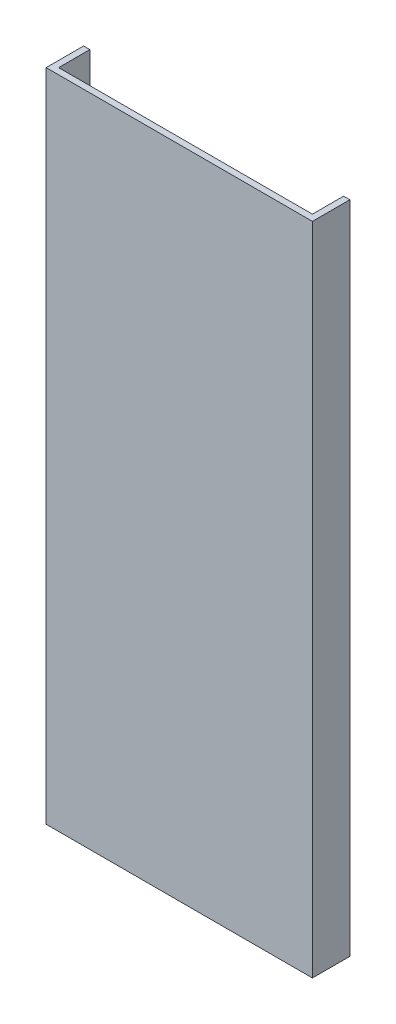
ISO-10303-21;
HEADER;
FILE_DESCRIPTION(('STEP AP214'),'2;1');
FILE_NAME('part.step','',(''),(''),'','','');
FILE_SCHEMA(('AUTOMOTIVE_DESIGN { 1 0 10303 214 1 1 1 1 }'));
ENDSEC;
DATA;
#1=APPLICATION_CONTEXT('core data for automotive mechanical design processes');
#2=APPLICATION_PROTOCOL_DEFINITION('international standard','automotive_design',2000,#1);
#3=PRODUCT_CONTEXT('',#1,'mechanical');
#4=PRODUCT('Part','Part','',(#3));
#5=PRODUCT_RELATED_PRODUCT_CATEGORY('part','',(#4));
#6=PRODUCT_DEFINITION_FORMATION('','',#4);
#7=PRODUCT_DEFINITION_CONTEXT('part definition',#1,'design');
#8=PRODUCT_DEFINITION('design','',#6,#7);
#9=PRODUCT_DEFINITION_SHAPE('','',#8);
#10=(LENGTH_UNIT() NAMED_UNIT(*) SI_UNIT(.MILLI.,.METRE.));
#11=(NAMED_UNIT(*) PLANE_ANGLE_UNIT() SI_UNIT($,.RADIAN.));
#12=(NAMED_UNIT(*) SI_UNIT($,.STERADIAN.) SOLID_ANGLE_UNIT());
#13=UNCERTAINTY_MEASURE_WITH_UNIT(LENGTH_MEASURE(1.E-05),#10,'distance_accuracy_value','');
#14=(GEOMETRIC_REPRESENTATION_CONTEXT(3) GLOBAL_UNCERTAINTY_ASSIGNED_CONTEXT((#13)) GLOBAL_UNIT_ASSIGNED_CONTEXT((#10,
#11,#12)) REPRESENTATION_CONTEXT('',''));
#15=CARTESIAN_POINT('',(0.,0.,0.));
#16=DIRECTION('',(0.,0.,1.));
#17=DIRECTION('',(1.,0.,0.));
#18=AXIS2_PLACEMENT_3D('',#15,#16,#17);
#19=CARTESIAN_POINT('',(64.,157.5,3.));
#20=DIRECTION('',(-1.,0.,0.));
#21=DIRECTION('',(0.,-1.,0.));
#22=AXIS2_PLACEMENT_3D('',#19,#20,#21);
#23=PLANE('',#22);
#24=DIRECTION('',(0.,0.,-1.));
#25=VECTOR('',#24,1.);
#26=CARTESIAN_POINT('',(64.,-157.5,3.));
#27=LINE('',#26,#25);
#28=CARTESIAN_POINT('',(64.,-157.5,3.));
#29=VERTEX_POINT('',#28);
#30=CARTESIAN_POINT('',(64.,-157.5,-15.));
#31=VERTEX_POINT('',#30);
#32=EDGE_CURVE('E202',#29,#31,#27,.T.);
#33=ORIENTED_EDGE('',*,*,#32,.T.);
#34=DIRECTION('',(0.,1.,0.));
#35=VECTOR('',#34,1.);
#36=CARTESIAN_POINT('',(64.,-157.5,-15.));
#37=LINE('',#36,#35);
#38=CARTESIAN_POINT('',(64.,157.5,-15.));
#39=VERTEX_POINT('',#38);
#40=EDGE_CURVE('E176',#31,#39,#37,.T.);
#41=ORIENTED_EDGE('',*,*,#40,.T.);
#42=DIRECTION('',(0.,0.,-1.));
#43=VECTOR('',#42,1.);
#44=CARTESIAN_POINT('',(64.,157.5,3.));
#45=LINE('',#44,#43);
#46=CARTESIAN_POINT('',(64.,157.5,3.));
#47=VERTEX_POINT('',#46);
#48=EDGE_CURVE('E12',#47,#39,#45,.T.);
#49=ORIENTED_EDGE('',*,*,#48,.F.);
#50=DIRECTION('',(0.,1.,0.));
#51=VECTOR('',#50,1.);
#52=CARTESIAN_POINT('',(64.,157.5,3.));
#53=LINE('',#52,#51);
#54=EDGE_CURVE('E193',#29,#47,#53,.T.);
#55=ORIENTED_EDGE('',*,*,#54,.F.);
#56=EDGE_LOOP('',(#33,#41,#49,#55));
#57=FACE_BOUND('',#56,.T.);
#58=ADVANCED_FACE('F81',(#57),#23,.F.);
#59=CARTESIAN_POINT('',(-64.,157.5,3.));
#60=DIRECTION('',(0.,-1.,0.));
#61=DIRECTION('',(0.,0.,-1.));
#62=AXIS2_PLACEMENT_3D('',#59,#60,#61);
#63=PLANE('',#62);
#64=ORIENTED_EDGE('',*,*,#48,.T.);
#65=DIRECTION('',(-1.,0.,0.));
#66=VECTOR('',#65,1.);
#67=CARTESIAN_POINT('',(64.,157.5,-15.));
#68=LINE('',#67,#66);
#69=CARTESIAN_POINT('',(61.,157.5,-15.));
#70=VERTEX_POINT('',#69);
#71=EDGE_CURVE('E185',#39,#70,#68,.T.);
#72=ORIENTED_EDGE('',*,*,#71,.T.);
#73=DIRECTION('',(0.,0.,1.));
#74=VECTOR('',#73,1.);
#75=CARTESIAN_POINT('',(61.,157.5,-15.));
#76=LINE('',#75,#74);
#77=CARTESIAN_POINT('',(61.,157.5,0.));
#78=VERTEX_POINT('',#77);
#79=EDGE_CURVE('E181',#70,#78,#76,.T.);
#80=ORIENTED_EDGE('',*,*,#79,.T.);
#81=DIRECTION('',(-1.,0.,0.));
#82=VECTOR('',#81,1.);
#83=CARTESIAN_POINT('',(-64.,157.5,0.));
#84=LINE('',#83,#82);
#85=CARTESIAN_POINT('',(-61.,157.5,0.));
#86=VERTEX_POINT('',#85);
#87=EDGE_CURVE('E159',#78,#86,#84,.T.);
#88=ORIENTED_EDGE('',*,*,#87,.T.);
#89=DIRECTION('',(0.,0.,1.));
#90=VECTOR('',#89,1.);
#91=CARTESIAN_POINT('',(-61.,157.5,-15.));
#92=LINE('',#91,#90);
#93=CARTESIAN_POINT('',(-61.,157.5,-15.));
#94=VERTEX_POINT('',#93);
#95=EDGE_CURVE('E156',#94,#86,#92,.T.);
#96=ORIENTED_EDGE('',*,*,#95,.F.);
#97=DIRECTION('',(1.,0.,0.));
#98=VECTOR('',#97,1.);
#99=CARTESIAN_POINT('',(-64.,157.5,-15.));
#100=LINE('',#99,#98);
#101=CARTESIAN_POINT('',(-64.,157.5,-15.));
#102=VERTEX_POINT('',#101);
#103=EDGE_CURVE('E144',#102,#94,#100,.T.);
#104=ORIENTED_EDGE('',*,*,#103,.F.);
#105=DIRECTION('',(0.,0.,-1.));
#106=VECTOR('',#105,1.);
#107=CARTESIAN_POINT('',(-64.,157.5,3.));
#108=LINE('',#107,#106);
#109=CARTESIAN_POINT('',(-64.,157.5,3.));
#110=VERTEX_POINT('',#109);
#111=EDGE_CURVE('E88',#110,#102,#108,.T.);
#112=ORIENTED_EDGE('',*,*,#111,.F.);
#113=DIRECTION('',(-1.,0.,0.));
#114=VECTOR('',#113,1.);
#115=CARTESIAN_POINT('',(-64.,157.5,3.));
#116=LINE('',#115,#114);
#117=EDGE_CURVE('E196',#47,#110,#116,.T.);
#118=ORIENTED_EDGE('',*,*,#117,.F.);
#119=EDGE_LOOP('',(#64,#72,#80,#88,#96,#104,#112,#118));
#120=FACE_BOUND('',#119,.T.);
#121=ADVANCED_FACE('F157',(#120),#63,.F.);
#122=CARTESIAN_POINT('',(-64.,157.5,3.));
#123=DIRECTION('',(1.,0.,0.));
#124=DIRECTION('',(0.,1.,0.));
#125=AXIS2_PLACEMENT_3D('',#122,#123,#124);
#126=PLANE('',#125);
#127=ORIENTED_EDGE('',*,*,#111,.T.);
#128=DIRECTION('',(0.,-1.,0.));
#129=VECTOR('',#128,1.);
#130=CARTESIAN_POINT('',(-64.,157.5,-15.));
#131=LINE('',#130,#129);
#132=CARTESIAN_POINT('',(-64.,-157.5,-15.));
#133=VERTEX_POINT('',#132);
#134=EDGE_CURVE('E151',#102,#133,#131,.T.);
#135=ORIENTED_EDGE('',*,*,#134,.T.);
#136=DIRECTION('',(0.,0.,-1.));
#137=VECTOR('',#136,1.);
#138=CARTESIAN_POINT('',(-64.,-157.5,3.));
#139=LINE('',#138,#137);
#140=CARTESIAN_POINT('',(-64.,-157.5,3.));
#141=VERTEX_POINT('',#140);
#142=EDGE_CURVE('E205',#141,#133,#139,.T.);
#143=ORIENTED_EDGE('',*,*,#142,.F.);
#144=DIRECTION('',(0.,-1.,0.));
#145=VECTOR('',#144,1.);
#146=CARTESIAN_POINT('',(-64.,157.5,3.));
#147=LINE('',#146,#145);
#148=EDGE_CURVE('E198',#110,#141,#147,.T.);
#149=ORIENTED_EDGE('',*,*,#148,.F.);
#150=EDGE_LOOP('',(#127,#135,#143,#149));
#151=FACE_BOUND('',#150,.T.);
#152=ADVANCED_FACE('F208',(#151),#126,.F.);
#153=CARTESIAN_POINT('',(-64.,-157.5,3.));
#154=DIRECTION('',(0.,1.,0.));
#155=DIRECTION('',(0.,0.,1.));
#156=AXIS2_PLACEMENT_3D('',#153,#154,#155);
#157=PLANE('',#156);
#158=ORIENTED_EDGE('',*,*,#142,.T.);
#159=DIRECTION('',(1.,0.,0.));
#160=VECTOR('',#159,1.);
#161=CARTESIAN_POINT('',(-64.,-157.5,-15.));
#162=LINE('',#161,#160);
#163=EDGE_CURVE('E166',#133,#31,#162,.T.);
#164=ORIENTED_EDGE('',*,*,#163,.T.);
#165=ORIENTED_EDGE('',*,*,#32,.F.);
#166=DIRECTION('',(1.,0.,0.));
#167=VECTOR('',#166,1.);
#168=CARTESIAN_POINT('',(-64.,-157.5,3.));
#169=LINE('',#168,#167);
#170=EDGE_CURVE('E200',#141,#29,#169,.T.);
#171=ORIENTED_EDGE('',*,*,#170,.F.);
#172=EDGE_LOOP('',(#158,#164,#165,#171));
#173=FACE_BOUND('',#172,.T.);
#174=ADVANCED_FACE('F233',(#173),#157,.F.);
#175=CARTESIAN_POINT('',(0.,0.,3.));
#176=DIRECTION('',(0.,0.,1.));
#177=DIRECTION('',(1.,0.,0.));
#178=AXIS2_PLACEMENT_3D('',#175,#176,#177);
#179=PLANE('',#178);
#180=ORIENTED_EDGE('',*,*,#54,.T.);
#181=ORIENTED_EDGE('',*,*,#117,.T.);
#182=ORIENTED_EDGE('',*,*,#148,.T.);
#183=ORIENTED_EDGE('',*,*,#170,.T.);
#184=EDGE_LOOP('',(#180,#181,#182,#183));
#185=FACE_BOUND('',#184,.T.);
#186=ADVANCED_FACE('F213',(#185),#179,.T.);
#187=CARTESIAN_POINT('',(0.,0.,0.));
#188=DIRECTION('',(0.,0.,1.));
#189=DIRECTION('',(1.,0.,0.));
#190=AXIS2_PLACEMENT_3D('',#187,#188,#189);
#191=PLANE('',#190);
#192=ORIENTED_EDGE('',*,*,#87,.F.);
#193=DIRECTION('',(0.,-1.,0.));
#194=VECTOR('',#193,1.);
#195=CARTESIAN_POINT('',(61.,157.5,0.));
#196=LINE('',#195,#194);
#197=CARTESIAN_POINT('',(61.,-154.5,0.));
#198=VERTEX_POINT('',#197);
#199=EDGE_CURVE('E95',#78,#198,#196,.T.);
#200=ORIENTED_EDGE('',*,*,#199,.T.);
#201=DIRECTION('',(1.,0.,0.));
#202=VECTOR('',#201,1.);
#203=CARTESIAN_POINT('',(-64.,-154.5,0.));
#204=LINE('',#203,#202);
#205=CARTESIAN_POINT('',(-61.,-154.5,0.));
#206=VERTEX_POINT('',#205);
#207=EDGE_CURVE('E177',#206,#198,#204,.T.);
#208=ORIENTED_EDGE('',*,*,#207,.F.);
#209=DIRECTION('',(0.,-1.,0.));
#210=VECTOR('',#209,1.);
#211=CARTESIAN_POINT('',(-61.,157.5,0.));
#212=LINE('',#211,#210);
#213=EDGE_CURVE('E100',#86,#206,#212,.T.);
#214=ORIENTED_EDGE('',*,*,#213,.F.);
#215=EDGE_LOOP('',(#192,#200,#208,#214));
#216=FACE_BOUND('',#215,.T.);
#217=ADVANCED_FACE('F225',(#216),#191,.F.);
#218=CARTESIAN_POINT('',(-61.,157.5,-15.));
#219=DIRECTION('',(-1.,0.,0.));
#220=DIRECTION('',(0.,-1.,0.));
#221=AXIS2_PLACEMENT_3D('',#218,#219,#220);
#222=PLANE('',#221);
#223=DIRECTION('',(0.,0.,1.));
#224=VECTOR('',#223,1.);
#225=CARTESIAN_POINT('',(-61.,-154.5,-15.));
#226=LINE('',#225,#224);
#227=CARTESIAN_POINT('',(-61.,-154.5,-15.));
#228=VERTEX_POINT('',#227);
#229=EDGE_CURVE('E161',#228,#206,#226,.T.);
#230=ORIENTED_EDGE('',*,*,#229,.F.);
#231=DIRECTION('',(0.,-1.,0.));
#232=VECTOR('',#231,1.);
#233=CARTESIAN_POINT('',(-61.,157.5,-15.));
#234=LINE('',#233,#232);
#235=EDGE_CURVE('E148',#94,#228,#234,.T.);
#236=ORIENTED_EDGE('',*,*,#235,.F.);
#237=ORIENTED_EDGE('',*,*,#95,.T.);
#238=ORIENTED_EDGE('',*,*,#213,.T.);
#239=EDGE_LOOP('',(#230,#236,#237,#238));
#240=FACE_BOUND('',#239,.T.);
#241=ADVANCED_FACE('F163',(#240),#222,.F.);
#242=CARTESIAN_POINT('',(0.,0.,-15.));
#243=DIRECTION('',(0.,0.,-1.));
#244=DIRECTION('',(-1.,0.,0.));
#245=AXIS2_PLACEMENT_3D('',#242,#243,#244);
#246=PLANE('',#245);
#247=ORIENTED_EDGE('',*,*,#235,.T.);
#248=DIRECTION('',(1.,0.,0.));
#249=VECTOR('',#248,1.);
#250=CARTESIAN_POINT('',(-64.,-154.5,-15.));
#251=LINE('',#250,#249);
#252=CARTESIAN_POINT('',(61.,-154.5,-15.));
#253=VERTEX_POINT('',#252);
#254=EDGE_CURVE('E174',#228,#253,#251,.T.);
#255=ORIENTED_EDGE('',*,*,#254,.T.);
#256=DIRECTION('',(0.,-1.,0.));
#257=VECTOR('',#256,1.);
#258=CARTESIAN_POINT('',(61.,157.5,-15.));
#259=LINE('',#258,#257);
#260=EDGE_CURVE('E182',#70,#253,#259,.T.);
#261=ORIENTED_EDGE('',*,*,#260,.F.);
#262=ORIENTED_EDGE('',*,*,#71,.F.);
#263=ORIENTED_EDGE('',*,*,#40,.F.);
#264=ORIENTED_EDGE('',*,*,#163,.F.);
#265=ORIENTED_EDGE('',*,*,#134,.F.);
#266=ORIENTED_EDGE('',*,*,#103,.T.);
#267=EDGE_LOOP('',(#247,#255,#261,#262,#263,#264,#265,#266));
#268=FACE_BOUND('',#267,.T.);
#269=ADVANCED_FACE('F146',(#268),#246,.T.);
#270=CARTESIAN_POINT('',(61.,157.5,-15.));
#271=DIRECTION('',(-1.,0.,0.));
#272=DIRECTION('',(0.,-1.,0.));
#273=AXIS2_PLACEMENT_3D('',#270,#271,#272);
#274=PLANE('',#273);
#275=DIRECTION('',(0.,0.,-1.));
#276=VECTOR('',#275,1.);
#277=CARTESIAN_POINT('',(61.,-154.5,-15.));
#278=LINE('',#277,#276);
#279=EDGE_CURVE('E172',#198,#253,#278,.T.);
#280=ORIENTED_EDGE('',*,*,#279,.F.);
#281=ORIENTED_EDGE('',*,*,#199,.F.);
#282=ORIENTED_EDGE('',*,*,#79,.F.);
#283=ORIENTED_EDGE('',*,*,#260,.T.);
#284=EDGE_LOOP('',(#280,#281,#282,#283));
#285=FACE_BOUND('',#284,.T.);
#286=ADVANCED_FACE('F222',(#285),#274,.T.);
#287=CARTESIAN_POINT('',(-64.,-154.5,-15.));
#288=DIRECTION('',(0.,-1.,0.));
#289=DIRECTION('',(1.,0.,0.));
#290=AXIS2_PLACEMENT_3D('',#287,#288,#289);
#291=PLANE('',#290);
#292=ORIENTED_EDGE('',*,*,#254,.F.);
#293=ORIENTED_EDGE('',*,*,#229,.T.);
#294=ORIENTED_EDGE('',*,*,#207,.T.);
#295=ORIENTED_EDGE('',*,*,#279,.T.);
#296=EDGE_LOOP('',(#292,#293,#294,#295));
#297=FACE_BOUND('',#296,.T.);
#298=ADVANCED_FACE('F224',(#297),#291,.F.);
#299=CLOSED_SHELL('',(#58,#121,#152,#174,#186,#217,#241,#269,#286,#298));
#300=MANIFOLD_SOLID_BREP('B2',#299);
#301=ADVANCED_BREP_SHAPE_REPRESENTATION('',(#18,#300),#14);
#302=SHAPE_DEFINITION_REPRESENTATION(#9,#301);
ENDSEC;
END-ISO-10303-21;
